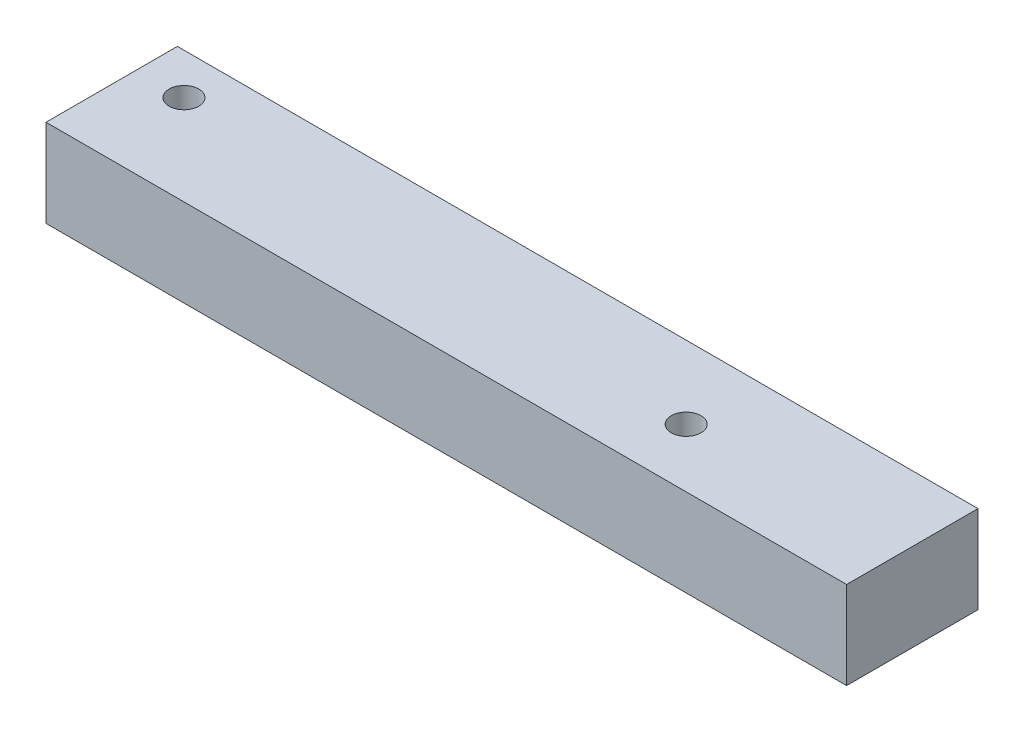
ISO-10303-21;
HEADER;
FILE_DESCRIPTION(('STEP AP214'),'2;1');
FILE_NAME('part.step','',(''),(''),'','','');
FILE_SCHEMA(('AUTOMOTIVE_DESIGN { 1 0 10303 214 1 1 1 1 }'));
ENDSEC;
DATA;
#1=APPLICATION_CONTEXT('core data for automotive mechanical design processes');
#2=APPLICATION_PROTOCOL_DEFINITION('international standard','automotive_design',2000,#1);
#3=PRODUCT_CONTEXT('',#1,'mechanical');
#4=PRODUCT('Part','Part','',(#3));
#5=PRODUCT_RELATED_PRODUCT_CATEGORY('part','',(#4));
#6=PRODUCT_DEFINITION_FORMATION('','',#4);
#7=PRODUCT_DEFINITION_CONTEXT('part definition',#1,'design');
#8=PRODUCT_DEFINITION('design','',#6,#7);
#9=PRODUCT_DEFINITION_SHAPE('','',#8);
#10=(LENGTH_UNIT() NAMED_UNIT(*) SI_UNIT(.MILLI.,.METRE.));
#11=(NAMED_UNIT(*) PLANE_ANGLE_UNIT() SI_UNIT($,.RADIAN.));
#12=(NAMED_UNIT(*) SI_UNIT($,.STERADIAN.) SOLID_ANGLE_UNIT());
#13=UNCERTAINTY_MEASURE_WITH_UNIT(LENGTH_MEASURE(1.E-05),#10,'distance_accuracy_value','');
#14=(GEOMETRIC_REPRESENTATION_CONTEXT(3) GLOBAL_UNCERTAINTY_ASSIGNED_CONTEXT((#13)) GLOBAL_UNIT_ASSIGNED_CONTEXT((#10,
#11,#12)) REPRESENTATION_CONTEXT('',''));
#15=CARTESIAN_POINT('',(0.,0.,0.));
#16=DIRECTION('',(0.,0.,1.));
#17=DIRECTION('',(1.,0.,0.));
#18=AXIS2_PLACEMENT_3D('',#15,#16,#17);
#19=CARTESIAN_POINT('',(0.,10.,0.));
#20=DIRECTION('',(0.,-1.,0.));
#21=DIRECTION('',(0.,0.,-1.));
#22=AXIS2_PLACEMENT_3D('',#19,#20,#21);
#23=PLANE('',#22);
#24=DIRECTION('',(0.,0.,1.));
#25=VECTOR('',#24,1.);
#26=CARTESIAN_POINT('',(-44.1621448352043,10.,-68.28125));
#27=LINE('',#26,#25);
#28=CARTESIAN_POINT('',(-44.1621448352043,10.,-83.28125));
#29=VERTEX_POINT('',#28);
#30=CARTESIAN_POINT('',(-44.1621448352043,10.,-68.28125));
#31=VERTEX_POINT('',#30);
#32=EDGE_CURVE('E93',#29,#31,#27,.T.);
#33=ORIENTED_EDGE('',*,*,#32,.T.);
#34=DIRECTION('',(1.,0.,0.));
#35=VECTOR('',#34,1.);
#36=CARTESIAN_POINT('',(14.2342412770572,10.,-68.28125));
#37=LINE('',#36,#35);
#38=CARTESIAN_POINT('',(47.2342412770572,10.,-68.28125));
#39=VERTEX_POINT('',#38);
#40=EDGE_CURVE('E88',#31,#39,#37,.T.);
#41=ORIENTED_EDGE('',*,*,#40,.T.);
#42=DIRECTION('',(0.,0.,-1.));
#43=VECTOR('',#42,1.);
#44=CARTESIAN_POINT('',(47.2342412770572,10.,-68.28125));
#45=LINE('',#44,#43);
#46=CARTESIAN_POINT('',(47.2342412770571,10.,-83.28125));
#47=VERTEX_POINT('',#46);
#48=EDGE_CURVE('E91',#39,#47,#45,.T.);
#49=ORIENTED_EDGE('',*,*,#48,.T.);
#50=DIRECTION('',(-1.,0.,0.));
#51=VECTOR('',#50,1.);
#52=CARTESIAN_POINT('',(-44.1621448352043,10.,-83.28125));
#53=LINE('',#52,#51);
#54=EDGE_CURVE('E58',#47,#29,#53,.T.);
#55=ORIENTED_EDGE('',*,*,#54,.T.);
#56=EDGE_LOOP('',(#33,#41,#49,#55));
#57=FACE_BOUND('',#56,.T.);
#58=CARTESIAN_POINT('',(-38.7190510776372,10.,-78.5879530223041));
#59=DIRECTION('',(0.,1.,0.));
#60=DIRECTION('',(0.,0.,1.));
#61=AXIS2_PLACEMENT_3D('',#58,#59,#60);
#62=CIRCLE('',#61,1.69999999999999);
#63=CARTESIAN_POINT('',(-38.7190510776372,10.,-76.8879530223041));
#64=VERTEX_POINT('',#63);
#65=EDGE_CURVE('E108',#64,#64,#62,.T.);
#66=ORIENTED_EDGE('',*,*,#65,.F.);
#67=EDGE_LOOP('',(#66));
#68=FACE_BOUND('',#67,.T.);
#69=CARTESIAN_POINT('',(22.2342412770572,10.,-74.9632658668375));
#70=DIRECTION('',(0.,1.,0.));
#71=DIRECTION('',(0.,0.,1.));
#72=AXIS2_PLACEMENT_3D('',#69,#70,#71);
#73=CIRCLE('',#72,1.70000000000001);
#74=CARTESIAN_POINT('',(22.2342412770572,10.,-73.2632658668375));
#75=VERTEX_POINT('',#74);
#76=EDGE_CURVE('E123',#75,#75,#73,.T.);
#77=ORIENTED_EDGE('',*,*,#76,.F.);
#78=EDGE_LOOP('',(#77));
#79=FACE_BOUND('',#78,.T.);
#80=ADVANCED_FACE('F41',(#57,#68,#79),#23,.F.);
#81=CARTESIAN_POINT('',(0.,0.,0.));
#82=DIRECTION('',(0.,-1.,0.));
#83=DIRECTION('',(0.,0.,-1.));
#84=AXIS2_PLACEMENT_3D('',#81,#82,#83);
#85=PLANE('',#84);
#86=CARTESIAN_POINT('',(-38.7190510776372,0.,-78.5879530223041));
#87=DIRECTION('',(0.,1.,0.));
#88=DIRECTION('',(0.,0.,1.));
#89=AXIS2_PLACEMENT_3D('',#86,#87,#88);
#90=CIRCLE('',#89,1.69999999999999);
#91=CARTESIAN_POINT('',(-38.7190510776372,0.,-76.8879530223041));
#92=VERTEX_POINT('',#91);
#93=EDGE_CURVE('E120',#92,#92,#90,.T.);
#94=ORIENTED_EDGE('',*,*,#93,.T.);
#95=EDGE_LOOP('',(#94));
#96=FACE_BOUND('',#95,.T.);
#97=DIRECTION('',(0.,0.,1.));
#98=VECTOR('',#97,1.);
#99=CARTESIAN_POINT('',(-44.1621448352043,0.,-68.28125));
#100=LINE('',#99,#98);
#101=CARTESIAN_POINT('',(-44.1621448352043,0.,-83.28125));
#102=VERTEX_POINT('',#101);
#103=CARTESIAN_POINT('',(-44.1621448352043,0.,-68.28125));
#104=VERTEX_POINT('',#103);
#105=EDGE_CURVE('E105',#102,#104,#100,.T.);
#106=ORIENTED_EDGE('',*,*,#105,.F.);
#107=DIRECTION('',(-1.,0.,0.));
#108=VECTOR('',#107,1.);
#109=CARTESIAN_POINT('',(-44.1621448352043,0.,-83.28125));
#110=LINE('',#109,#108);
#111=CARTESIAN_POINT('',(47.2342412770571,0.,-83.28125));
#112=VERTEX_POINT('',#111);
#113=EDGE_CURVE('E81',#112,#102,#110,.T.);
#114=ORIENTED_EDGE('',*,*,#113,.F.);
#115=DIRECTION('',(0.,0.,-1.));
#116=VECTOR('',#115,1.);
#117=CARTESIAN_POINT('',(47.2342412770572,0.,-68.28125));
#118=LINE('',#117,#116);
#119=CARTESIAN_POINT('',(47.2342412770572,0.,-68.28125));
#120=VERTEX_POINT('',#119);
#121=EDGE_CURVE('E75',#120,#112,#118,.T.);
#122=ORIENTED_EDGE('',*,*,#121,.F.);
#123=DIRECTION('',(1.,0.,0.));
#124=VECTOR('',#123,1.);
#125=CARTESIAN_POINT('',(14.2342412770572,0.,-68.28125));
#126=LINE('',#125,#124);
#127=EDGE_CURVE('E97',#104,#120,#126,.T.);
#128=ORIENTED_EDGE('',*,*,#127,.F.);
#129=EDGE_LOOP('',(#106,#114,#122,#128));
#130=FACE_BOUND('',#129,.T.);
#131=CARTESIAN_POINT('',(22.2342412770572,0.,-74.9632658668375));
#132=DIRECTION('',(0.,1.,0.));
#133=DIRECTION('',(0.,0.,1.));
#134=AXIS2_PLACEMENT_3D('',#131,#132,#133);
#135=CIRCLE('',#134,1.70000000000001);
#136=CARTESIAN_POINT('',(22.2342412770572,0.,-73.2632658668375));
#137=VERTEX_POINT('',#136);
#138=EDGE_CURVE('E126',#137,#137,#135,.T.);
#139=ORIENTED_EDGE('',*,*,#138,.T.);
#140=EDGE_LOOP('',(#139));
#141=FACE_BOUND('',#140,.T.);
#142=ADVANCED_FACE('F116',(#96,#130,#141),#85,.T.);
#143=CARTESIAN_POINT('',(-44.1621448352043,10.,-68.28125));
#144=DIRECTION('',(1.,0.,0.));
#145=DIRECTION('',(0.,0.,-1.));
#146=AXIS2_PLACEMENT_3D('',#143,#144,#145);
#147=PLANE('',#146);
#148=ORIENTED_EDGE('',*,*,#105,.T.);
#149=DIRECTION('',(0.,-1.,0.));
#150=VECTOR('',#149,1.);
#151=CARTESIAN_POINT('',(-44.1621448352043,10.,-68.28125));
#152=LINE('',#151,#150);
#153=EDGE_CURVE('E11',#31,#104,#152,.T.);
#154=ORIENTED_EDGE('',*,*,#153,.F.);
#155=ORIENTED_EDGE('',*,*,#32,.F.);
#156=DIRECTION('',(0.,-1.,0.));
#157=VECTOR('',#156,1.);
#158=CARTESIAN_POINT('',(-44.1621448352043,10.,-83.28125));
#159=LINE('',#158,#157);
#160=EDGE_CURVE('E101',#29,#102,#159,.T.);
#161=ORIENTED_EDGE('',*,*,#160,.T.);
#162=EDGE_LOOP('',(#148,#154,#155,#161));
#163=FACE_BOUND('',#162,.T.);
#164=ADVANCED_FACE('F43',(#163),#147,.F.);
#165=CARTESIAN_POINT('',(14.2342412770572,10.,-68.28125));
#166=DIRECTION('',(0.,0.,-1.));
#167=DIRECTION('',(-1.,0.,0.));
#168=AXIS2_PLACEMENT_3D('',#165,#166,#167);
#169=PLANE('',#168);
#170=ORIENTED_EDGE('',*,*,#127,.T.);
#171=DIRECTION('',(0.,-1.,0.));
#172=VECTOR('',#171,1.);
#173=CARTESIAN_POINT('',(47.2342412770572,10.,-68.28125));
#174=LINE('',#173,#172);
#175=EDGE_CURVE('E50',#39,#120,#174,.T.);
#176=ORIENTED_EDGE('',*,*,#175,.F.);
#177=ORIENTED_EDGE('',*,*,#40,.F.);
#178=ORIENTED_EDGE('',*,*,#153,.T.);
#179=EDGE_LOOP('',(#170,#176,#177,#178));
#180=FACE_BOUND('',#179,.T.);
#181=ADVANCED_FACE('F96',(#180),#169,.F.);
#182=CARTESIAN_POINT('',(47.2342412770572,10.,-68.28125));
#183=DIRECTION('',(-1.,0.,0.));
#184=DIRECTION('',(0.,0.,1.));
#185=AXIS2_PLACEMENT_3D('',#182,#183,#184);
#186=PLANE('',#185);
#187=ORIENTED_EDGE('',*,*,#121,.T.);
#188=DIRECTION('',(0.,-1.,0.));
#189=VECTOR('',#188,1.);
#190=CARTESIAN_POINT('',(47.2342412770571,10.,-83.28125));
#191=LINE('',#190,#189);
#192=EDGE_CURVE('E98',#47,#112,#191,.T.);
#193=ORIENTED_EDGE('',*,*,#192,.F.);
#194=ORIENTED_EDGE('',*,*,#48,.F.);
#195=ORIENTED_EDGE('',*,*,#175,.T.);
#196=EDGE_LOOP('',(#187,#193,#194,#195));
#197=FACE_BOUND('',#196,.T.);
#198=ADVANCED_FACE('F99',(#197),#186,.F.);
#199=CARTESIAN_POINT('',(-44.1621448352043,10.,-83.28125));
#200=DIRECTION('',(0.,0.,1.));
#201=DIRECTION('',(1.,0.,0.));
#202=AXIS2_PLACEMENT_3D('',#199,#200,#201);
#203=PLANE('',#202);
#204=ORIENTED_EDGE('',*,*,#113,.T.);
#205=ORIENTED_EDGE('',*,*,#160,.F.);
#206=ORIENTED_EDGE('',*,*,#54,.F.);
#207=ORIENTED_EDGE('',*,*,#192,.T.);
#208=EDGE_LOOP('',(#204,#205,#206,#207));
#209=FACE_BOUND('',#208,.T.);
#210=ADVANCED_FACE('F113',(#209),#203,.F.);
#211=CARTESIAN_POINT('',(-38.7190510776372,10.,-78.5879530223041));
#212=DIRECTION('',(0.,-1.,0.));
#213=DIRECTION('',(0.,0.,-1.));
#214=AXIS2_PLACEMENT_3D('',#211,#212,#213);
#215=CYLINDRICAL_SURFACE('',#214,1.69999999999999);
#216=ORIENTED_EDGE('',*,*,#65,.T.);
#217=EDGE_LOOP('',(#216));
#218=FACE_BOUND('',#217,.T.);
#219=ORIENTED_EDGE('',*,*,#93,.F.);
#220=EDGE_LOOP('',(#219));
#221=FACE_BOUND('',#220,.T.);
#222=ADVANCED_FACE('F143',(#218,#221),#215,.F.);
#223=CARTESIAN_POINT('',(22.2342412770572,10.,-74.9632658668375));
#224=DIRECTION('',(0.,-1.,0.));
#225=DIRECTION('',(0.,0.,-1.));
#226=AXIS2_PLACEMENT_3D('',#223,#224,#225);
#227=CYLINDRICAL_SURFACE('',#226,1.70000000000001);
#228=ORIENTED_EDGE('',*,*,#76,.T.);
#229=EDGE_LOOP('',(#228));
#230=FACE_BOUND('',#229,.T.);
#231=ORIENTED_EDGE('',*,*,#138,.F.);
#232=EDGE_LOOP('',(#231));
#233=FACE_BOUND('',#232,.T.);
#234=ADVANCED_FACE('F132',(#230,#233),#227,.F.);
#235=CLOSED_SHELL('',(#80,#142,#164,#181,#198,#210,#222,#234));
#236=MANIFOLD_SOLID_BREP('B2',#235);
#237=ADVANCED_BREP_SHAPE_REPRESENTATION('',(#18,#236),#14);
#238=SHAPE_DEFINITION_REPRESENTATION(#9,#237);
ENDSEC;
END-ISO-10303-21;
